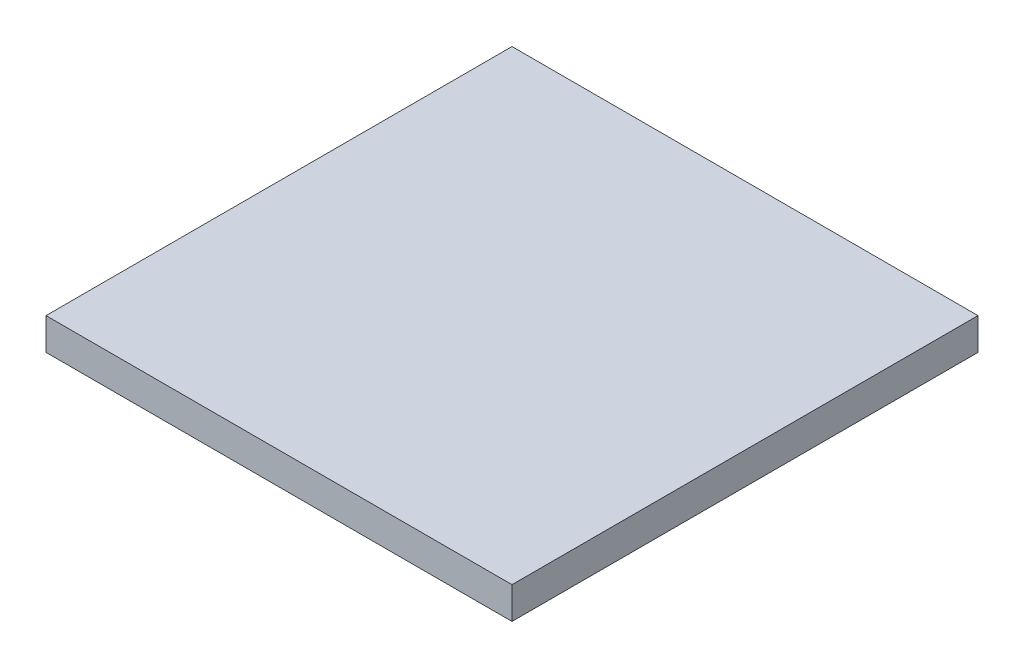
ISO-10303-21;
HEADER;
FILE_DESCRIPTION(('STEP AP214'),'2;1');
FILE_NAME('part.step','',(''),(''),'','','');
FILE_SCHEMA(('AUTOMOTIVE_DESIGN { 1 0 10303 214 1 1 1 1 }'));
ENDSEC;
DATA;
#1=APPLICATION_CONTEXT('core data for automotive mechanical design processes');
#2=APPLICATION_PROTOCOL_DEFINITION('international standard','automotive_design',2000,#1);
#3=PRODUCT_CONTEXT('',#1,'mechanical');
#4=PRODUCT('Part','Part','',(#3));
#5=PRODUCT_RELATED_PRODUCT_CATEGORY('part','',(#4));
#6=PRODUCT_DEFINITION_FORMATION('','',#4);
#7=PRODUCT_DEFINITION_CONTEXT('part definition',#1,'design');
#8=PRODUCT_DEFINITION('design','',#6,#7);
#9=PRODUCT_DEFINITION_SHAPE('','',#8);
#10=(LENGTH_UNIT() NAMED_UNIT(*) SI_UNIT(.MILLI.,.METRE.));
#11=(NAMED_UNIT(*) PLANE_ANGLE_UNIT() SI_UNIT($,.RADIAN.));
#12=(NAMED_UNIT(*) SI_UNIT($,.STERADIAN.) SOLID_ANGLE_UNIT());
#13=UNCERTAINTY_MEASURE_WITH_UNIT(LENGTH_MEASURE(1.E-05),#10,'distance_accuracy_value','');
#14=(GEOMETRIC_REPRESENTATION_CONTEXT(3) GLOBAL_UNCERTAINTY_ASSIGNED_CONTEXT((#13)) GLOBAL_UNIT_ASSIGNED_CONTEXT((#10,
#11,#12)) REPRESENTATION_CONTEXT('',''));
#15=CARTESIAN_POINT('',(0.,0.,0.));
#16=DIRECTION('',(0.,0.,1.));
#17=DIRECTION('',(1.,0.,0.));
#18=AXIS2_PLACEMENT_3D('',#15,#16,#17);
#19=CARTESIAN_POINT('',(-24.4525547445255,3.42,-18.7043795620438));
#20=DIRECTION('',(1.,0.,0.));
#21=DIRECTION('',(0.,0.,-1.));
#22=AXIS2_PLACEMENT_3D('',#19,#20,#21);
#23=PLANE('',#22);
#24=DIRECTION('',(0.,0.,1.));
#25=VECTOR('',#24,1.);
#26=CARTESIAN_POINT('',(-24.4525547445255,0.,-18.7043795620438));
#27=LINE('',#26,#25);
#28=CARTESIAN_POINT('',(-24.4525547445255,0.,-18.7043795620438));
#29=VERTEX_POINT('',#28);
#30=CARTESIAN_POINT('',(-24.4525547445255,0.,31.2956204379562));
#31=VERTEX_POINT('',#30);
#32=EDGE_CURVE('E107',#29,#31,#27,.T.);
#33=ORIENTED_EDGE('',*,*,#32,.T.);
#34=DIRECTION('',(0.,-1.,0.));
#35=VECTOR('',#34,1.);
#36=CARTESIAN_POINT('',(-24.4525547445255,3.42,31.2956204379562));
#37=LINE('',#36,#35);
#38=CARTESIAN_POINT('',(-24.4525547445255,3.42,31.2956204379562));
#39=VERTEX_POINT('',#38);
#40=EDGE_CURVE('E11',#39,#31,#37,.T.);
#41=ORIENTED_EDGE('',*,*,#40,.F.);
#42=DIRECTION('',(0.,0.,1.));
#43=VECTOR('',#42,1.);
#44=CARTESIAN_POINT('',(-24.4525547445255,3.42,-18.7043795620438));
#45=LINE('',#44,#43);
#46=CARTESIAN_POINT('',(-24.4525547445255,3.42,-18.7043795620438));
#47=VERTEX_POINT('',#46);
#48=EDGE_CURVE('E91',#47,#39,#45,.T.);
#49=ORIENTED_EDGE('',*,*,#48,.F.);
#50=DIRECTION('',(0.,-1.,0.));
#51=VECTOR('',#50,1.);
#52=CARTESIAN_POINT('',(-24.4525547445255,3.42,-18.7043795620438));
#53=LINE('',#52,#51);
#54=EDGE_CURVE('E103',#47,#29,#53,.T.);
#55=ORIENTED_EDGE('',*,*,#54,.T.);
#56=EDGE_LOOP('',(#33,#41,#49,#55));
#57=FACE_BOUND('',#56,.T.);
#58=ADVANCED_FACE('F39',(#57),#23,.F.);
#59=CARTESIAN_POINT('',(-24.4525547445255,3.42,31.2956204379562));
#60=DIRECTION('',(0.,0.,-1.));
#61=DIRECTION('',(-1.,0.,0.));
#62=AXIS2_PLACEMENT_3D('',#59,#60,#61);
#63=PLANE('',#62);
#64=DIRECTION('',(1.,0.,0.));
#65=VECTOR('',#64,1.);
#66=CARTESIAN_POINT('',(-24.4525547445255,0.,31.2956204379562));
#67=LINE('',#66,#65);
#68=CARTESIAN_POINT('',(25.5474452554745,0.,31.2956204379562));
#69=VERTEX_POINT('',#68);
#70=EDGE_CURVE('E96',#31,#69,#67,.T.);
#71=ORIENTED_EDGE('',*,*,#70,.T.);
#72=DIRECTION('',(0.,-1.,0.));
#73=VECTOR('',#72,1.);
#74=CARTESIAN_POINT('',(25.5474452554745,3.42,31.2956204379562));
#75=LINE('',#74,#73);
#76=CARTESIAN_POINT('',(25.5474452554745,3.42,31.2956204379562));
#77=VERTEX_POINT('',#76);
#78=EDGE_CURVE('E48',#77,#69,#75,.T.);
#79=ORIENTED_EDGE('',*,*,#78,.F.);
#80=DIRECTION('',(1.,0.,0.));
#81=VECTOR('',#80,1.);
#82=CARTESIAN_POINT('',(-24.4525547445255,3.42,31.2956204379562));
#83=LINE('',#82,#81);
#84=EDGE_CURVE('E86',#39,#77,#83,.T.);
#85=ORIENTED_EDGE('',*,*,#84,.F.);
#86=ORIENTED_EDGE('',*,*,#40,.T.);
#87=EDGE_LOOP('',(#71,#79,#85,#86));
#88=FACE_BOUND('',#87,.T.);
#89=ADVANCED_FACE('F95',(#88),#63,.F.);
#90=CARTESIAN_POINT('',(25.5474452554745,3.42,-18.7043795620438));
#91=DIRECTION('',(-1.,0.,0.));
#92=DIRECTION('',(0.,0.,1.));
#93=AXIS2_PLACEMENT_3D('',#90,#91,#92);
#94=PLANE('',#93);
#95=DIRECTION('',(0.,0.,-1.));
#96=VECTOR('',#95,1.);
#97=CARTESIAN_POINT('',(25.5474452554745,0.,-18.7043795620438));
#98=LINE('',#97,#96);
#99=CARTESIAN_POINT('',(25.5474452554745,0.,-18.7043795620438));
#100=VERTEX_POINT('',#99);
#101=EDGE_CURVE('E73',#69,#100,#98,.T.);
#102=ORIENTED_EDGE('',*,*,#101,.T.);
#103=DIRECTION('',(0.,-1.,0.));
#104=VECTOR('',#103,1.);
#105=CARTESIAN_POINT('',(25.5474452554745,3.42,-18.7043795620438));
#106=LINE('',#105,#104);
#107=CARTESIAN_POINT('',(25.5474452554745,3.42,-18.7043795620438));
#108=VERTEX_POINT('',#107);
#109=EDGE_CURVE('E98',#108,#100,#106,.T.);
#110=ORIENTED_EDGE('',*,*,#109,.F.);
#111=DIRECTION('',(0.,0.,-1.));
#112=VECTOR('',#111,1.);
#113=CARTESIAN_POINT('',(25.5474452554745,3.42,-18.7043795620438));
#114=LINE('',#113,#112);
#115=EDGE_CURVE('E89',#77,#108,#114,.T.);
#116=ORIENTED_EDGE('',*,*,#115,.F.);
#117=ORIENTED_EDGE('',*,*,#78,.T.);
#118=EDGE_LOOP('',(#102,#110,#116,#117));
#119=FACE_BOUND('',#118,.T.);
#120=ADVANCED_FACE('F99',(#119),#94,.F.);
#121=CARTESIAN_POINT('',(-24.4525547445255,3.42,-18.7043795620438));
#122=DIRECTION('',(0.,0.,1.));
#123=DIRECTION('',(1.,0.,0.));
#124=AXIS2_PLACEMENT_3D('',#121,#122,#123);
#125=PLANE('',#124);
#126=DIRECTION('',(-1.,0.,0.));
#127=VECTOR('',#126,1.);
#128=CARTESIAN_POINT('',(-24.4525547445255,0.,-18.7043795620438));
#129=LINE('',#128,#127);
#130=EDGE_CURVE('E79',#100,#29,#129,.T.);
#131=ORIENTED_EDGE('',*,*,#130,.T.);
#132=ORIENTED_EDGE('',*,*,#54,.F.);
#133=DIRECTION('',(-1.,0.,0.));
#134=VECTOR('',#133,1.);
#135=CARTESIAN_POINT('',(-24.4525547445255,3.42,-18.7043795620438));
#136=LINE('',#135,#134);
#137=EDGE_CURVE('E56',#108,#47,#136,.T.);
#138=ORIENTED_EDGE('',*,*,#137,.F.);
#139=ORIENTED_EDGE('',*,*,#109,.T.);
#140=EDGE_LOOP('',(#131,#132,#138,#139));
#141=FACE_BOUND('',#140,.T.);
#142=ADVANCED_FACE('F120',(#141),#125,.F.);
#143=CARTESIAN_POINT('',(0.,3.42,0.));
#144=DIRECTION('',(0.,1.,0.));
#145=DIRECTION('',(0.,0.,1.));
#146=AXIS2_PLACEMENT_3D('',#143,#144,#145);
#147=PLANE('',#146);
#148=ORIENTED_EDGE('',*,*,#48,.T.);
#149=ORIENTED_EDGE('',*,*,#84,.T.);
#150=ORIENTED_EDGE('',*,*,#115,.T.);
#151=ORIENTED_EDGE('',*,*,#137,.T.);
#152=EDGE_LOOP('',(#148,#149,#150,#151));
#153=FACE_BOUND('',#152,.T.);
#154=ADVANCED_FACE('F87',(#153),#147,.T.);
#155=CARTESIAN_POINT('',(0.,0.,0.));
#156=DIRECTION('',(0.,1.,0.));
#157=DIRECTION('',(0.,0.,1.));
#158=AXIS2_PLACEMENT_3D('',#155,#156,#157);
#159=PLANE('',#158);
#160=ORIENTED_EDGE('',*,*,#32,.F.);
#161=ORIENTED_EDGE('',*,*,#130,.F.);
#162=ORIENTED_EDGE('',*,*,#101,.F.);
#163=ORIENTED_EDGE('',*,*,#70,.F.);
#164=EDGE_LOOP('',(#160,#161,#162,#163));
#165=FACE_BOUND('',#164,.T.);
#166=ADVANCED_FACE('F123',(#165),#159,.F.);
#167=CLOSED_SHELL('',(#58,#89,#120,#142,#154,#166));
#168=MANIFOLD_SOLID_BREP('B2',#167);
#169=ADVANCED_BREP_SHAPE_REPRESENTATION('',(#18,#168),#14);
#170=SHAPE_DEFINITION_REPRESENTATION(#9,#169);
ENDSEC;
END-ISO-10303-21;
